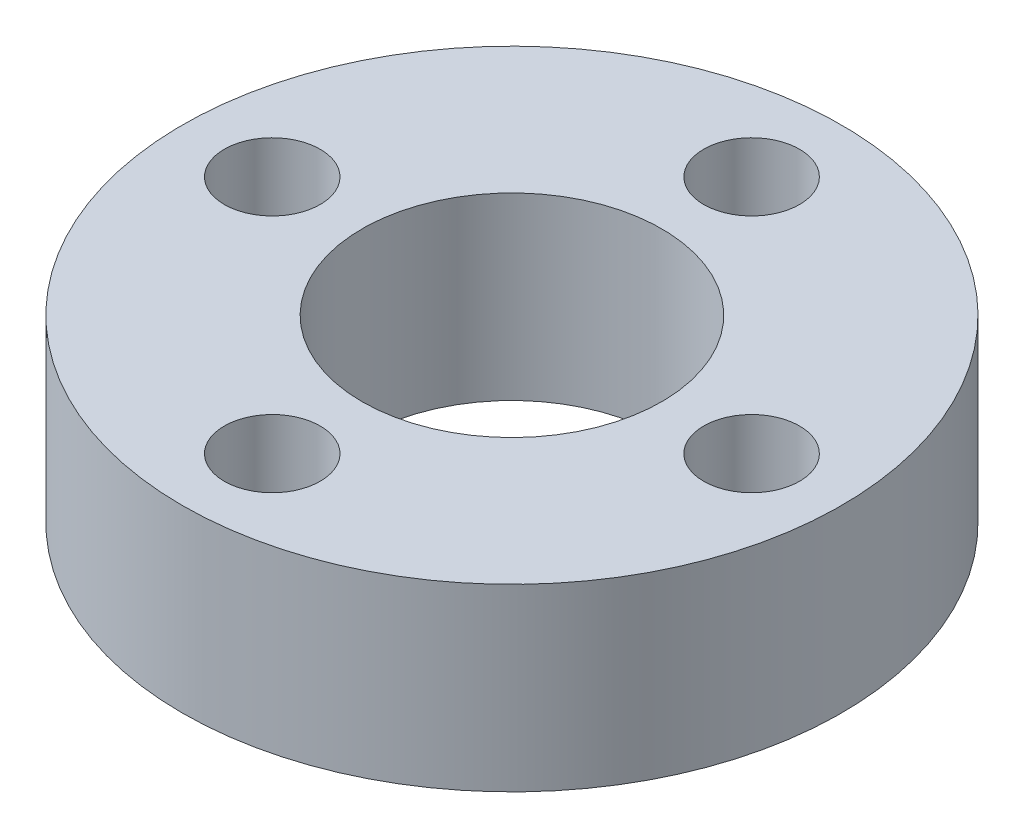
ISO-10303-21;
HEADER;
FILE_DESCRIPTION(('STEP AP214'),'2;1');
FILE_NAME('part.step','',(''),(''),'','','');
FILE_SCHEMA(('AUTOMOTIVE_DESIGN { 1 0 10303 214 1 1 1 1 }'));
ENDSEC;
DATA;
#1=APPLICATION_CONTEXT('core data for automotive mechanical design processes');
#2=APPLICATION_PROTOCOL_DEFINITION('international standard','automotive_design',2000,#1);
#3=PRODUCT_CONTEXT('',#1,'mechanical');
#4=PRODUCT('Part','Part','',(#3));
#5=PRODUCT_RELATED_PRODUCT_CATEGORY('part','',(#4));
#6=PRODUCT_DEFINITION_FORMATION('','',#4);
#7=PRODUCT_DEFINITION_CONTEXT('part definition',#1,'design');
#8=PRODUCT_DEFINITION('design','',#6,#7);
#9=PRODUCT_DEFINITION_SHAPE('','',#8);
#10=(LENGTH_UNIT() NAMED_UNIT(*) SI_UNIT(.MILLI.,.METRE.));
#11=(NAMED_UNIT(*) PLANE_ANGLE_UNIT() SI_UNIT($,.RADIAN.));
#12=(NAMED_UNIT(*) SI_UNIT($,.STERADIAN.) SOLID_ANGLE_UNIT());
#13=UNCERTAINTY_MEASURE_WITH_UNIT(LENGTH_MEASURE(1.E-05),#10,'distance_accuracy_value','');
#14=(GEOMETRIC_REPRESENTATION_CONTEXT(3) GLOBAL_UNCERTAINTY_ASSIGNED_CONTEXT((#13)) GLOBAL_UNIT_ASSIGNED_CONTEXT((#10,
#11,#12)) REPRESENTATION_CONTEXT('',''));
#15=CARTESIAN_POINT('',(0.,0.,0.));
#16=DIRECTION('',(0.,0.,1.));
#17=DIRECTION('',(1.,0.,0.));
#18=AXIS2_PLACEMENT_3D('',#15,#16,#17);
#19=CARTESIAN_POINT('',(0.,15.,0.));
#20=DIRECTION('',(0.,1.,0.));
#21=DIRECTION('',(0.,0.,1.));
#22=AXIS2_PLACEMENT_3D('',#19,#20,#21);
#23=PLANE('',#22);
#24=CARTESIAN_POINT('',(1.51667227226898E-12,15.,20.));
#25=DIRECTION('',(0.,1.,0.));
#26=DIRECTION('',(0.,0.,1.));
#27=AXIS2_PLACEMENT_3D('',#24,#25,#26);
#28=CIRCLE('',#27,4.);
#29=CARTESIAN_POINT('',(1.51667227226898E-12,15.,24.));
#30=VERTEX_POINT('',#29);
#31=EDGE_CURVE('E74',#30,#30,#28,.T.);
#32=ORIENTED_EDGE('',*,*,#31,.F.);
#33=EDGE_LOOP('',(#32));
#34=FACE_BOUND('',#33,.T.);
#35=CARTESIAN_POINT('',(0.,15.,-20.));
#36=DIRECTION('',(0.,1.,0.));
#37=DIRECTION('',(0.,0.,1.));
#38=AXIS2_PLACEMENT_3D('',#35,#36,#37);
#39=CIRCLE('',#38,4.);
#40=CARTESIAN_POINT('',(0.,15.,-16.));
#41=VERTEX_POINT('',#40);
#42=EDGE_CURVE('E58',#41,#41,#39,.T.);
#43=ORIENTED_EDGE('',*,*,#42,.F.);
#44=EDGE_LOOP('',(#43));
#45=FACE_BOUND('',#44,.T.);
#46=CARTESIAN_POINT('',(0.,15.,0.));
#47=DIRECTION('',(0.,1.,0.));
#48=DIRECTION('',(0.,0.,1.));
#49=AXIS2_PLACEMENT_3D('',#46,#47,#48);
#50=CIRCLE('',#49,27.5);
#51=CARTESIAN_POINT('',(0.,15.,27.5));
#52=VERTEX_POINT('',#51);
#53=EDGE_CURVE('E10',#52,#52,#50,.T.);
#54=ORIENTED_EDGE('',*,*,#53,.T.);
#55=EDGE_LOOP('',(#54));
#56=FACE_BOUND('',#55,.T.);
#57=CARTESIAN_POINT('',(0.,15.,0.));
#58=DIRECTION('',(0.,1.,0.));
#59=DIRECTION('',(0.,0.,1.));
#60=AXIS2_PLACEMENT_3D('',#57,#58,#59);
#61=CIRCLE('',#60,12.5);
#62=CARTESIAN_POINT('',(0.,15.,12.5));
#63=VERTEX_POINT('',#62);
#64=EDGE_CURVE('E52',#63,#63,#61,.T.);
#65=ORIENTED_EDGE('',*,*,#64,.F.);
#66=EDGE_LOOP('',(#65));
#67=FACE_BOUND('',#66,.T.);
#68=CARTESIAN_POINT('',(20.0000000000008,15.,-7.58336136134489E-13));
#69=DIRECTION('',(0.,1.,0.));
#70=DIRECTION('',(0.,0.,1.));
#71=AXIS2_PLACEMENT_3D('',#68,#69,#70);
#72=CIRCLE('',#71,4.);
#73=CARTESIAN_POINT('',(20.0000000000008,15.,3.99999999999924));
#74=VERTEX_POINT('',#73);
#75=EDGE_CURVE('E66',#74,#74,#72,.T.);
#76=ORIENTED_EDGE('',*,*,#75,.F.);
#77=EDGE_LOOP('',(#76));
#78=FACE_BOUND('',#77,.T.);
#79=CARTESIAN_POINT('',(-19.9999999999992,15.,7.60785429732783E-13));
#80=DIRECTION('',(0.,1.,0.));
#81=DIRECTION('',(0.,0.,1.));
#82=AXIS2_PLACEMENT_3D('',#79,#80,#81);
#83=CIRCLE('',#82,4.);
#84=CARTESIAN_POINT('',(-19.9999999999992,15.,4.00000000000076));
#85=VERTEX_POINT('',#84);
#86=EDGE_CURVE('E82',#85,#85,#83,.T.);
#87=ORIENTED_EDGE('',*,*,#86,.F.);
#88=EDGE_LOOP('',(#87));
#89=FACE_BOUND('',#88,.T.);
#90=ADVANCED_FACE('F39',(#34,#45,#56,#67,#78,#89),#23,.T.);
#91=CARTESIAN_POINT('',(0.,0.,0.));
#92=DIRECTION('',(0.,1.,0.));
#93=DIRECTION('',(0.,0.,1.));
#94=AXIS2_PLACEMENT_3D('',#91,#92,#93);
#95=PLANE('',#94);
#96=CARTESIAN_POINT('',(0.,0.,0.));
#97=DIRECTION('',(0.,1.,0.));
#98=DIRECTION('',(0.,0.,1.));
#99=AXIS2_PLACEMENT_3D('',#96,#97,#98);
#100=CIRCLE('',#99,27.5);
#101=CARTESIAN_POINT('',(0.,0.,27.5));
#102=VERTEX_POINT('',#101);
#103=EDGE_CURVE('E43',#102,#102,#100,.T.);
#104=ORIENTED_EDGE('',*,*,#103,.F.);
#105=EDGE_LOOP('',(#104));
#106=FACE_BOUND('',#105,.T.);
#107=CARTESIAN_POINT('',(0.,0.,0.));
#108=DIRECTION('',(0.,1.,0.));
#109=DIRECTION('',(0.,0.,1.));
#110=AXIS2_PLACEMENT_3D('',#107,#108,#109);
#111=CIRCLE('',#110,12.5);
#112=CARTESIAN_POINT('',(0.,0.,12.5));
#113=VERTEX_POINT('',#112);
#114=EDGE_CURVE('E54',#113,#113,#111,.T.);
#115=ORIENTED_EDGE('',*,*,#114,.T.);
#116=EDGE_LOOP('',(#115));
#117=FACE_BOUND('',#116,.T.);
#118=CARTESIAN_POINT('',(0.,0.,-20.));
#119=DIRECTION('',(0.,1.,0.));
#120=DIRECTION('',(0.,0.,1.));
#121=AXIS2_PLACEMENT_3D('',#118,#119,#120);
#122=CIRCLE('',#121,4.);
#123=CARTESIAN_POINT('',(0.,0.,-16.));
#124=VERTEX_POINT('',#123);
#125=EDGE_CURVE('E62',#124,#124,#122,.T.);
#126=ORIENTED_EDGE('',*,*,#125,.T.);
#127=EDGE_LOOP('',(#126));
#128=FACE_BOUND('',#127,.T.);
#129=CARTESIAN_POINT('',(20.0000000000008,0.,-7.58336136134489E-13));
#130=DIRECTION('',(0.,1.,0.));
#131=DIRECTION('',(0.,0.,1.));
#132=AXIS2_PLACEMENT_3D('',#129,#130,#131);
#133=CIRCLE('',#132,4.);
#134=CARTESIAN_POINT('',(20.0000000000008,0.,3.99999999999924));
#135=VERTEX_POINT('',#134);
#136=EDGE_CURVE('E70',#135,#135,#133,.T.);
#137=ORIENTED_EDGE('',*,*,#136,.T.);
#138=EDGE_LOOP('',(#137));
#139=FACE_BOUND('',#138,.T.);
#140=CARTESIAN_POINT('',(1.51667227226898E-12,0.,20.));
#141=DIRECTION('',(0.,1.,0.));
#142=DIRECTION('',(0.,0.,1.));
#143=AXIS2_PLACEMENT_3D('',#140,#141,#142);
#144=CIRCLE('',#143,4.);
#145=CARTESIAN_POINT('',(1.51667227226898E-12,0.,24.));
#146=VERTEX_POINT('',#145);
#147=EDGE_CURVE('E78',#146,#146,#144,.T.);
#148=ORIENTED_EDGE('',*,*,#147,.T.);
#149=EDGE_LOOP('',(#148));
#150=FACE_BOUND('',#149,.T.);
#151=CARTESIAN_POINT('',(-19.9999999999992,0.,7.60785429732783E-13));
#152=DIRECTION('',(0.,1.,0.));
#153=DIRECTION('',(0.,0.,1.));
#154=AXIS2_PLACEMENT_3D('',#151,#152,#153);
#155=CIRCLE('',#154,4.);
#156=CARTESIAN_POINT('',(-19.9999999999992,0.,4.00000000000076));
#157=VERTEX_POINT('',#156);
#158=EDGE_CURVE('E86',#157,#157,#155,.T.);
#159=ORIENTED_EDGE('',*,*,#158,.T.);
#160=EDGE_LOOP('',(#159));
#161=FACE_BOUND('',#160,.T.);
#162=ADVANCED_FACE('F98',(#106,#117,#128,#139,#150,#161),#95,.F.);
#163=CARTESIAN_POINT('',(0.,15.,0.));
#164=DIRECTION('',(0.,-1.,0.));
#165=DIRECTION('',(0.,0.,-1.));
#166=AXIS2_PLACEMENT_3D('',#163,#164,#165);
#167=CYLINDRICAL_SURFACE('',#166,27.5);
#168=ORIENTED_EDGE('',*,*,#53,.F.);
#169=EDGE_LOOP('',(#168));
#170=FACE_BOUND('',#169,.T.);
#171=ORIENTED_EDGE('',*,*,#103,.T.);
#172=EDGE_LOOP('',(#171));
#173=FACE_BOUND('',#172,.T.);
#174=ADVANCED_FACE('F41',(#170,#173),#167,.T.);
#175=CARTESIAN_POINT('',(0.,15.,0.));
#176=DIRECTION('',(0.,-1.,0.));
#177=DIRECTION('',(0.,0.,-1.));
#178=AXIS2_PLACEMENT_3D('',#175,#176,#177);
#179=CYLINDRICAL_SURFACE('',#178,12.5);
#180=ORIENTED_EDGE('',*,*,#64,.T.);
#181=EDGE_LOOP('',(#180));
#182=FACE_BOUND('',#181,.T.);
#183=ORIENTED_EDGE('',*,*,#114,.F.);
#184=EDGE_LOOP('',(#183));
#185=FACE_BOUND('',#184,.T.);
#186=ADVANCED_FACE('F108',(#182,#185),#179,.F.);
#187=CARTESIAN_POINT('',(0.,15.,-20.));
#188=DIRECTION('',(0.,-1.,0.));
#189=DIRECTION('',(0.,0.,-1.));
#190=AXIS2_PLACEMENT_3D('',#187,#188,#189);
#191=CYLINDRICAL_SURFACE('',#190,4.);
#192=ORIENTED_EDGE('',*,*,#42,.T.);
#193=EDGE_LOOP('',(#192));
#194=FACE_BOUND('',#193,.T.);
#195=ORIENTED_EDGE('',*,*,#125,.F.);
#196=EDGE_LOOP('',(#195));
#197=FACE_BOUND('',#196,.T.);
#198=ADVANCED_FACE('F111',(#194,#197),#191,.F.);
#199=CARTESIAN_POINT('',(20.0000000000008,15.,-7.58336136134489E-13));
#200=DIRECTION('',(0.,-1.,0.));
#201=DIRECTION('',(0.,0.,-1.));
#202=AXIS2_PLACEMENT_3D('',#199,#200,#201);
#203=CYLINDRICAL_SURFACE('',#202,4.);
#204=ORIENTED_EDGE('',*,*,#75,.T.);
#205=EDGE_LOOP('',(#204));
#206=FACE_BOUND('',#205,.T.);
#207=ORIENTED_EDGE('',*,*,#136,.F.);
#208=EDGE_LOOP('',(#207));
#209=FACE_BOUND('',#208,.T.);
#210=ADVANCED_FACE('F115',(#206,#209),#203,.F.);
#211=CARTESIAN_POINT('',(1.51667227226898E-12,15.,20.));
#212=DIRECTION('',(0.,-1.,0.));
#213=DIRECTION('',(0.,0.,-1.));
#214=AXIS2_PLACEMENT_3D('',#211,#212,#213);
#215=CYLINDRICAL_SURFACE('',#214,4.);
#216=ORIENTED_EDGE('',*,*,#31,.T.);
#217=EDGE_LOOP('',(#216));
#218=FACE_BOUND('',#217,.T.);
#219=ORIENTED_EDGE('',*,*,#147,.F.);
#220=EDGE_LOOP('',(#219));
#221=FACE_BOUND('',#220,.T.);
#222=ADVANCED_FACE('F119',(#218,#221),#215,.F.);
#223=CARTESIAN_POINT('',(-19.9999999999992,15.,7.60785429732783E-13));
#224=DIRECTION('',(0.,-1.,0.));
#225=DIRECTION('',(0.,0.,-1.));
#226=AXIS2_PLACEMENT_3D('',#223,#224,#225);
#227=CYLINDRICAL_SURFACE('',#226,4.);
#228=ORIENTED_EDGE('',*,*,#86,.T.);
#229=EDGE_LOOP('',(#228));
#230=FACE_BOUND('',#229,.T.);
#231=ORIENTED_EDGE('',*,*,#158,.F.);
#232=EDGE_LOOP('',(#231));
#233=FACE_BOUND('',#232,.T.);
#234=ADVANCED_FACE('F94',(#230,#233),#227,.F.);
#235=CLOSED_SHELL('',(#90,#162,#174,#186,#198,#210,#222,#234));
#236=MANIFOLD_SOLID_BREP('B2',#235);
#237=ADVANCED_BREP_SHAPE_REPRESENTATION('',(#18,#236),#14);
#238=SHAPE_DEFINITION_REPRESENTATION(#9,#237);
ENDSEC;
END-ISO-10303-21;
